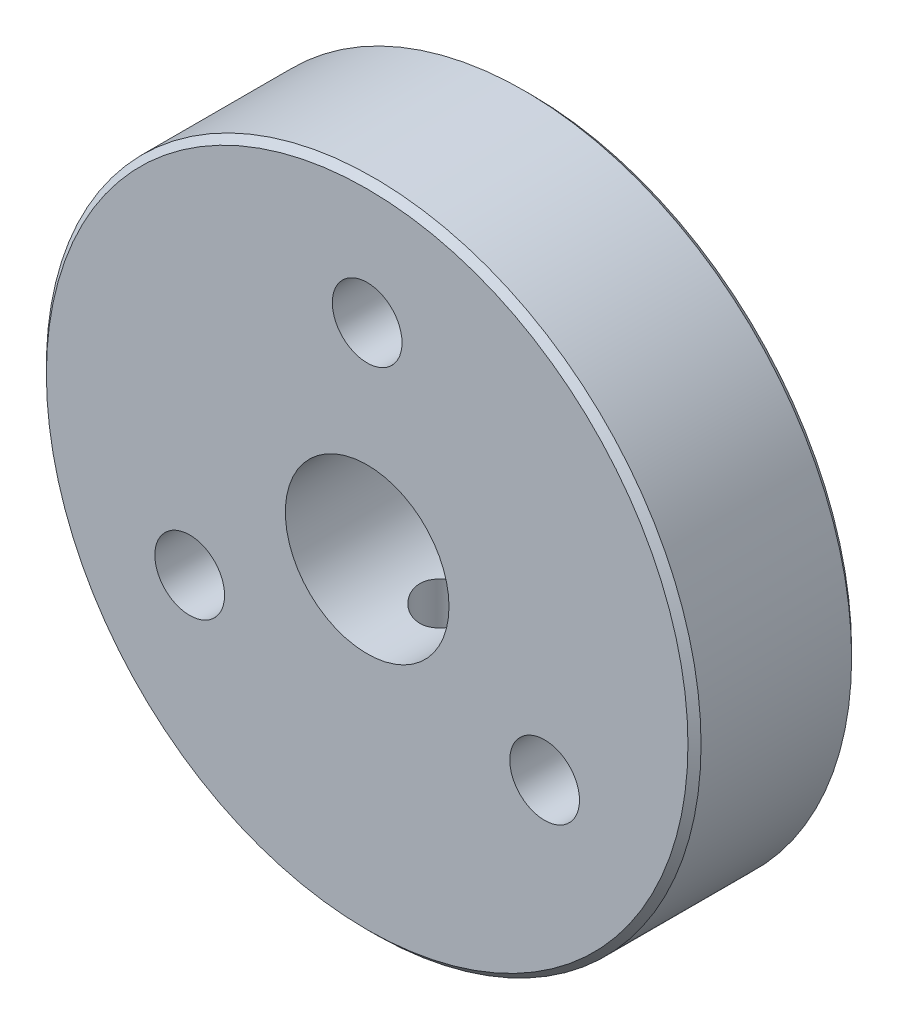
ISO-10303-21;
HEADER;
FILE_DESCRIPTION(('STEP AP214'),'2;1');
FILE_NAME('part.step','',(''),(''),'','','');
FILE_SCHEMA(('AUTOMOTIVE_DESIGN { 1 0 10303 214 1 1 1 1 }'));
ENDSEC;
DATA;
#1=APPLICATION_CONTEXT('core data for automotive mechanical design processes');
#2=APPLICATION_PROTOCOL_DEFINITION('international standard','automotive_design',2000,#1);
#3=PRODUCT_CONTEXT('',#1,'mechanical');
#4=PRODUCT('Part','Part','',(#3));
#5=PRODUCT_RELATED_PRODUCT_CATEGORY('part','',(#4));
#6=PRODUCT_DEFINITION_FORMATION('','',#4);
#7=PRODUCT_DEFINITION_CONTEXT('part definition',#1,'design');
#8=PRODUCT_DEFINITION('design','',#6,#7);
#9=PRODUCT_DEFINITION_SHAPE('','',#8);
#10=(LENGTH_UNIT() NAMED_UNIT(*) SI_UNIT(.MILLI.,.METRE.));
#11=(NAMED_UNIT(*) PLANE_ANGLE_UNIT() SI_UNIT($,.RADIAN.));
#12=(NAMED_UNIT(*) SI_UNIT($,.STERADIAN.) SOLID_ANGLE_UNIT());
#13=UNCERTAINTY_MEASURE_WITH_UNIT(LENGTH_MEASURE(1.E-05),#10,'distance_accuracy_value','');
#14=(GEOMETRIC_REPRESENTATION_CONTEXT(3) GLOBAL_UNCERTAINTY_ASSIGNED_CONTEXT((#13)) GLOBAL_UNIT_ASSIGNED_CONTEXT((#10,
#11,#12)) REPRESENTATION_CONTEXT('',''));
#15=CARTESIAN_POINT('',(0.,0.,0.));
#16=DIRECTION('',(0.,0.,1.));
#17=DIRECTION('',(1.,0.,0.));
#18=AXIS2_PLACEMENT_3D('',#15,#16,#17);
#19=CARTESIAN_POINT('',(0.,0.,3.175));
#20=DIRECTION('',(0.,0.,1.));
#21=DIRECTION('',(1.,0.,0.));
#22=AXIS2_PLACEMENT_3D('',#19,#20,#21);
#23=PLANE('',#22);
#24=CARTESIAN_POINT('',(0.,7.9502,3.175));
#25=DIRECTION('',(0.,0.,1.));
#26=DIRECTION('',(1.,0.,0.));
#27=AXIS2_PLACEMENT_3D('',#24,#25,#26);
#28=CIRCLE('',#27,1.35255);
#29=CARTESIAN_POINT('',(1.35255000000003,7.9502,3.175));
#30=VERTEX_POINT('',#29);
#31=EDGE_CURVE('E131',#30,#30,#28,.T.);
#32=ORIENTED_EDGE('',*,*,#31,.F.);
#33=EDGE_LOOP('',(#32));
#34=FACE_BOUND('',#33,.T.);
#35=CARTESIAN_POINT('',(6.88507516516696,-3.97510000000015,3.175));
#36=DIRECTION('',(0.,0.,1.));
#37=DIRECTION('',(1.,0.,0.));
#38=AXIS2_PLACEMENT_3D('',#35,#36,#37);
#39=CIRCLE('',#38,1.35255);
#40=CARTESIAN_POINT('',(8.23762516516696,-3.97510000000015,3.175));
#41=VERTEX_POINT('',#40);
#42=EDGE_CURVE('E123',#41,#41,#39,.T.);
#43=ORIENTED_EDGE('',*,*,#42,.F.);
#44=EDGE_LOOP('',(#43));
#45=FACE_BOUND('',#44,.T.);
#46=CARTESIAN_POINT('',(-6.88507516516706,-3.97509999999997,3.175));
#47=DIRECTION('',(0.,0.,1.));
#48=DIRECTION('',(1.,0.,0.));
#49=AXIS2_PLACEMENT_3D('',#46,#47,#48);
#50=CIRCLE('',#49,1.35255);
#51=CARTESIAN_POINT('',(-5.53252516516706,-3.97509999999997,3.175));
#52=VERTEX_POINT('',#51);
#53=EDGE_CURVE('E115',#52,#52,#50,.T.);
#54=ORIENTED_EDGE('',*,*,#53,.F.);
#55=EDGE_LOOP('',(#54));
#56=FACE_BOUND('',#55,.T.);
#57=CARTESIAN_POINT('',(0.,0.,3.175));
#58=DIRECTION('',(0.,0.,1.));
#59=DIRECTION('',(1.,0.,0.));
#60=AXIS2_PLACEMENT_3D('',#57,#58,#59);
#61=CIRCLE('',#60,12.446);
#62=CARTESIAN_POINT('',(12.446,0.,3.175));
#63=VERTEX_POINT('',#62);
#64=EDGE_CURVE('E80',#63,#63,#61,.T.);
#65=ORIENTED_EDGE('',*,*,#64,.T.);
#66=EDGE_LOOP('',(#65));
#67=FACE_BOUND('',#66,.T.);
#68=CARTESIAN_POINT('',(0.,0.,3.175));
#69=DIRECTION('',(0.,0.,1.));
#70=DIRECTION('',(1.,0.,0.));
#71=AXIS2_PLACEMENT_3D('',#68,#69,#70);
#72=CIRCLE('',#71,3.175);
#73=CARTESIAN_POINT('',(3.175,0.,3.175));
#74=VERTEX_POINT('',#73);
#75=EDGE_CURVE('E103',#74,#74,#72,.T.);
#76=ORIENTED_EDGE('',*,*,#75,.F.);
#77=EDGE_LOOP('',(#76));
#78=FACE_BOUND('',#77,.T.);
#79=ADVANCED_FACE('F66',(#34,#45,#56,#67,#78),#23,.T.);
#80=CARTESIAN_POINT('',(0.,0.,-3.175));
#81=DIRECTION('',(0.,0.,1.));
#82=DIRECTION('',(1.,0.,0.));
#83=AXIS2_PLACEMENT_3D('',#80,#81,#82);
#84=PLANE('',#83);
#85=CARTESIAN_POINT('',(0.,7.9502,-3.175));
#86=DIRECTION('',(0.,0.,1.));
#87=DIRECTION('',(1.,0.,0.));
#88=AXIS2_PLACEMENT_3D('',#85,#86,#87);
#89=CIRCLE('',#88,1.35255);
#90=CARTESIAN_POINT('',(1.35255000000003,7.9502,-3.175));
#91=VERTEX_POINT('',#90);
#92=EDGE_CURVE('E127',#91,#91,#89,.T.);
#93=ORIENTED_EDGE('',*,*,#92,.T.);
#94=EDGE_LOOP('',(#93));
#95=FACE_BOUND('',#94,.T.);
#96=CARTESIAN_POINT('',(6.88507516516696,-3.97510000000015,-3.175));
#97=DIRECTION('',(0.,0.,1.));
#98=DIRECTION('',(1.,0.,0.));
#99=AXIS2_PLACEMENT_3D('',#96,#97,#98);
#100=CIRCLE('',#99,1.35255);
#101=CARTESIAN_POINT('',(8.23762516516696,-3.97510000000015,-3.175));
#102=VERTEX_POINT('',#101);
#103=EDGE_CURVE('E119',#102,#102,#100,.T.);
#104=ORIENTED_EDGE('',*,*,#103,.T.);
#105=EDGE_LOOP('',(#104));
#106=FACE_BOUND('',#105,.T.);
#107=CARTESIAN_POINT('',(-6.88507516516706,-3.97509999999997,-3.175));
#108=DIRECTION('',(0.,0.,1.));
#109=DIRECTION('',(1.,0.,0.));
#110=AXIS2_PLACEMENT_3D('',#107,#108,#109);
#111=CIRCLE('',#110,1.35255);
#112=CARTESIAN_POINT('',(-5.53252516516706,-3.97509999999997,-3.175));
#113=VERTEX_POINT('',#112);
#114=EDGE_CURVE('E108',#113,#113,#111,.T.);
#115=ORIENTED_EDGE('',*,*,#114,.T.);
#116=EDGE_LOOP('',(#115));
#117=FACE_BOUND('',#116,.T.);
#118=CARTESIAN_POINT('',(0.,0.,-3.175));
#119=DIRECTION('',(0.,0.,1.));
#120=DIRECTION('',(1.,0.,0.));
#121=AXIS2_PLACEMENT_3D('',#118,#119,#120);
#122=CIRCLE('',#121,12.446);
#123=CARTESIAN_POINT('',(12.446,0.,-3.175));
#124=VERTEX_POINT('',#123);
#125=EDGE_CURVE('E86',#124,#124,#122,.F.);
#126=ORIENTED_EDGE('',*,*,#125,.T.);
#127=EDGE_LOOP('',(#126));
#128=FACE_BOUND('',#127,.T.);
#129=CARTESIAN_POINT('',(0.,0.,-3.175));
#130=DIRECTION('',(0.,0.,1.));
#131=DIRECTION('',(1.,0.,0.));
#132=AXIS2_PLACEMENT_3D('',#129,#130,#131);
#133=CIRCLE('',#132,3.175);
#134=CARTESIAN_POINT('',(3.175,0.,-3.175));
#135=VERTEX_POINT('',#134);
#136=EDGE_CURVE('E104',#135,#135,#133,.T.);
#137=ORIENTED_EDGE('',*,*,#136,.T.);
#138=EDGE_LOOP('',(#137));
#139=FACE_BOUND('',#138,.T.);
#140=ADVANCED_FACE('F165',(#95,#106,#117,#128,#139),#84,.F.);
#141=CARTESIAN_POINT('',(0.,0.,3.175));
#142=DIRECTION('',(0.,0.,-1.));
#143=DIRECTION('',(-1.,0.,0.));
#144=AXIS2_PLACEMENT_3D('',#141,#142,#143);
#145=CYLINDRICAL_SURFACE('',#144,12.7);
#146=CARTESIAN_POINT('',(-1.01856599499896,-12.6590885794555,-1.01455469719306));
#147=CARTESIAN_POINT('',(-1.06777935996552,-12.6551289481404,-0.9602667270985));
#148=CARTESIAN_POINT('',(-1.11288456501695,-12.651211115827,-0.902219990724273));
#149=CARTESIAN_POINT('',(-1.19403357340193,-12.6438107010971,-0.780033012646186));
#150=CARTESIAN_POINT('',(-1.23006837411032,-12.6403285528189,-0.715886803345802));
#151=CARTESIAN_POINT('',(-1.29651083842735,-12.6336979635186,-0.57424882101493));
#152=CARTESIAN_POINT('',(-1.32555920488906,-12.6306533053362,-0.496110456718519));
#153=CARTESIAN_POINT('',(-1.37057776919976,-12.6258477472939,-0.336115955753952));
#154=CARTESIAN_POINT('',(-1.3865448955865,-12.6240871489408,-0.254258950711837));
#155=CARTESIAN_POINT('',(-1.40532031918826,-12.6220113395381,-0.0867678463022914));
#156=CARTESIAN_POINT('',(-1.40775905049329,-12.6217367271964,-0.00109156300284166));
#157=CARTESIAN_POINT('',(-1.39842856543426,-12.6227737863963,0.169476775339011));
#158=CARTESIAN_POINT('',(-1.3866585193942,-12.6240855505692,0.254368784294553));
#159=CARTESIAN_POINT('',(-1.34901934120854,-12.6281631934404,0.421631019079898));
#160=CARTESIAN_POINT('',(-1.32304187235654,-12.6309402396324,0.503976664085946));
#161=CARTESIAN_POINT('',(-1.25749687040558,-12.6376335191431,0.663032295279327));
#162=CARTESIAN_POINT('',(-1.21792937904054,-12.6415497489635,0.739742298772402));
#163=CARTESIAN_POINT('',(-1.1267581566759,-12.6499990559549,0.88415968335355));
#164=CARTESIAN_POINT('',(-1.07532475103146,-12.6545230574904,0.951974949778696));
#165=CARTESIAN_POINT('',(-0.961400783980244,-12.6636867746431,1.07758271499526));
#166=CARTESIAN_POINT('',(-0.898912341269262,-12.6683264679419,1.13537713008602));
#167=CARTESIAN_POINT('',(-0.767006606972737,-12.6769831684423,1.23698526581895));
#168=CARTESIAN_POINT('',(-0.697922745648417,-12.681016654809,1.28122996568699));
#169=CARTESIAN_POINT('',(-0.552982890773223,-12.6881621868982,1.35682679815604));
#170=CARTESIAN_POINT('',(-0.477129191132589,-12.6912745432077,1.38818327780107));
#171=CARTESIAN_POINT('',(-0.32478372848182,-12.6960638396279,1.43555286393101));
#172=CARTESIAN_POINT('',(-0.248502877593077,-12.6978032940712,1.45223872832953));
#173=CARTESIAN_POINT('',(-0.0941899566152355,-12.6998848216853,1.47214085010944));
#174=CARTESIAN_POINT('',(-0.0161583044664618,-12.7002272248569,1.47536028843215));
#175=CARTESIAN_POINT('',(0.136652858436766,-12.6994870933027,1.46832741707033));
#176=CARTESIAN_POINT('',(0.211453702272819,-12.6984519399579,1.45852308369543));
#177=CARTESIAN_POINT('',(0.358341870872775,-12.6951561732157,1.42659289105142));
#178=CARTESIAN_POINT('',(0.430429235475015,-12.6928955778173,1.40446721275529));
#179=CARTESIAN_POINT('',(0.570187088972885,-12.6873874598792,1.34859162903364));
#180=CARTESIAN_POINT('',(0.637841262835307,-12.684136516135,1.31480137301867));
#181=CARTESIAN_POINT('',(0.766764961308602,-12.6769967660973,1.23674713548987));
#182=CARTESIAN_POINT('',(0.82803351837979,-12.6731078633702,1.19248157008545));
#183=CARTESIAN_POINT('',(0.944880939297458,-12.6649421632559,1.09304114172753));
#184=CARTESIAN_POINT('',(1.00016981793522,-12.6606563817003,1.03752654405262));
#185=CARTESIAN_POINT('',(1.10114484432322,-12.6522746357751,0.918352947369969));
#186=CARTESIAN_POINT('',(1.14682889220139,-12.648178713066,0.854692172274255));
#187=CARTESIAN_POINT('',(1.22955117035318,-12.6404120349761,0.717817186822992));
#188=CARTESIAN_POINT('',(1.26608215021364,-12.6367703091586,0.644294596924393));
#189=CARTESIAN_POINT('',(1.32680592005392,-12.6305392322281,0.492278273812366));
#190=CARTESIAN_POINT('',(1.35099641179657,-12.6279500771593,0.413783617681345));
#191=CARTESIAN_POINT('',(1.38716913168147,-12.6240290574787,0.251081374436562));
#192=CARTESIAN_POINT('',(1.39869060477786,-12.6227447663364,0.166769936497564));
#193=CARTESIAN_POINT('',(1.4077254209835,-12.6217403560962,-0.00261298018836294));
#194=CARTESIAN_POINT('',(1.40523720852784,-12.6220204106955,-0.0876845422885616));
#195=CARTESIAN_POINT('',(1.38616427795824,-12.6241293503412,-0.257475802201915));
#196=CARTESIAN_POINT('',(1.36937490554097,-12.6259807200312,-0.342172355019299));
#197=CARTESIAN_POINT('',(1.32179639132477,-12.631049926044,-0.507504436863517));
#198=CARTESIAN_POINT('',(1.29100687275052,-12.6342677991422,-0.588139856531279));
#199=CARTESIAN_POINT('',(1.21636932432176,-12.641670655105,-0.742446131312238));
#200=CARTESIAN_POINT('',(1.17260623426251,-12.6458493088541,-0.816158302750123));
#201=CARTESIAN_POINT('',(1.07298510911216,-12.6546905969574,-0.954880966479328));
#202=CARTESIAN_POINT('',(1.01712854059988,-12.6593531725905,-1.01989251235192));
#203=CARTESIAN_POINT('',(0.896536093161028,-12.668455483673,-1.13725892611313));
#204=CARTESIAN_POINT('',(0.832105153555628,-12.6728977584332,-1.18992650297639));
#205=CARTESIAN_POINT('',(0.694921562684951,-12.6811589075347,-1.28306989202841));
#206=CARTESIAN_POINT('',(0.622171498875595,-12.6849779748171,-1.32354948083279));
#207=CARTESIAN_POINT('',(0.474085698717592,-12.6913541717671,-1.3891414405637));
#208=CARTESIAN_POINT('',(0.399032778063965,-12.6939622321142,-1.41488736754523));
#209=CARTESIAN_POINT('',(0.24555252831014,-12.6978575095129,-1.45285210271825));
#210=CARTESIAN_POINT('',(0.167126284837625,-12.6991451482471,-1.46507522957532));
#211=CARTESIAN_POINT('',(0.0126513729709438,-12.700218829601,-1.4752828972933));
#212=CARTESIAN_POINT('',(-0.0633594548010816,-12.7000654537086,-1.47384186666785));
#213=CARTESIAN_POINT('',(-0.214037788189186,-12.6984197524929,-1.45814822237988));
#214=CARTESIAN_POINT('',(-0.288705207681909,-12.6969273416362,-1.44389479030261));
#215=CARTESIAN_POINT('',(-0.433884111852518,-12.6927923295812,-1.40330674867784));
#216=CARTESIAN_POINT('',(-0.504427574104128,-12.6901604630619,-1.37708477128717));
#217=CARTESIAN_POINT('',(-0.640224581249642,-12.6840345280549,-1.31352121902724));
#218=CARTESIAN_POINT('',(-0.70548127451704,-12.6805409778056,-1.27618632496805));
#219=CARTESIAN_POINT('',(-0.813319304512204,-12.674014610559,-1.202452409577));
#220=CARTESIAN_POINT('',(-0.857433192243053,-12.6710922637695,-1.16825325335951));
#221=CARTESIAN_POINT('',(-0.941344620762744,-12.6651347320017,-1.09494476980917));
#222=CARTESIAN_POINT('',(-0.981143062828058,-12.6620995707631,-1.05583647144129));
#223=CARTESIAN_POINT('',(-1.01856599499896,-12.6590885794555,-1.01455469719306));
#224=B_SPLINE_CURVE_WITH_KNOTS('',3,(#146,#147,#148,#149,#150,#151,#152,#153,#154,#155,#156,
#157,#158,#159,#160,#161,#162,#163,#164,#165,#166,#167,#168,#169,#170,#171,#172,#173,#174,#175,
#176,#177,#178,#179,#180,#181,#182,#183,#184,#185,#186,#187,#188,#189,#190,#191,#192,#193,#194,
#195,#196,#197,#198,#199,#200,#201,#202,#203,#204,#205,#206,#207,#208,#209,#210,#211,#212,#213,
#214,#215,#216,#217,#218,#219,#220,#221,#222,#223),.UNSPECIFIED.,.T.,.F.,(4,2,2,2,2,2,2,2,2,2,2,
2,2,2,2,2,2,2,2,2,2,2,2,2,2,2,2,2,2,2,2,2,2,2,2,2,2,2,4),(0.,0.219980916490328,
0.440179316710136,0.689278460018113,0.938436074809918,1.19436780396887,1.45031447816351,
1.70824061445378,1.96616595867985,2.22059701230149,2.4749793569785,2.72013710595396,
2.96521209813486,3.19835386278341,3.4314405532674,3.65671381484796,3.88198376775563,
4.10804092486646,4.33413228419696,4.56849124234626,4.80290138445377,5.04832845767661,
5.29380122146604,5.54793317280883,5.80209334223966,6.05995293592681,6.31781946960427,
6.57403366044263,6.83021679751475,7.07896081801577,7.32762768225191,7.564591796646,
7.80148021189261,8.02845571544188,8.25544571848217,8.48034228453971,8.70510392048968,
8.87241728997574,9.03969564865547),.UNSPECIFIED.);
#225=CARTESIAN_POINT('',(-1.01856599499896,-12.6590885794555,-1.01455469719306));
#226=VERTEX_POINT('',#225);
#227=EDGE_CURVE('E12',#226,#226,#224,.T.);
#228=ORIENTED_EDGE('',*,*,#227,.T.);
#229=EDGE_LOOP('',(#228));
#230=FACE_BOUND('',#229,.T.);
#231=CARTESIAN_POINT('',(0.,0.,-2.921));
#232=DIRECTION('',(0.,0.,1.));
#233=DIRECTION('',(1.,0.,0.));
#234=AXIS2_PLACEMENT_3D('',#231,#232,#233);
#235=CIRCLE('',#234,12.7);
#236=CARTESIAN_POINT('',(12.7,0.,-2.921));
#237=VERTEX_POINT('',#236);
#238=EDGE_CURVE('E93',#237,#237,#235,.T.);
#239=ORIENTED_EDGE('',*,*,#238,.T.);
#240=EDGE_LOOP('',(#239));
#241=FACE_BOUND('',#240,.T.);
#242=CARTESIAN_POINT('',(0.,0.,2.921));
#243=DIRECTION('',(0.,0.,1.));
#244=DIRECTION('',(1.,0.,0.));
#245=AXIS2_PLACEMENT_3D('',#242,#243,#244);
#246=CIRCLE('',#245,12.7);
#247=CARTESIAN_POINT('',(12.7,0.,2.921));
#248=VERTEX_POINT('',#247);
#249=EDGE_CURVE('E99',#248,#248,#246,.F.);
#250=ORIENTED_EDGE('',*,*,#249,.T.);
#251=EDGE_LOOP('',(#250));
#252=FACE_BOUND('',#251,.T.);
#253=ADVANCED_FACE('F171',(#230,#241,#252),#145,.T.);
#254=CARTESIAN_POINT('',(0.,0.,3.175));
#255=DIRECTION('',(0.,0.,-1.));
#256=DIRECTION('',(-1.,0.,0.));
#257=AXIS2_PLACEMENT_3D('',#254,#255,#256);
#258=CYLINDRICAL_SURFACE('',#257,3.175);
#259=CARTESIAN_POINT('',(0.,-3.175,-1.1303));
#260=CARTESIAN_POINT('',(-0.0614285544766779,-3.17500087649076,-1.13030122375743));
#261=CARTESIAN_POINT('',(-0.122848391480888,-3.17320130070143,-1.12527632101687));
#262=CARTESIAN_POINT('',(-0.243864611742385,-3.1662010034201,-1.10538141456425));
#263=CARTESIAN_POINT('',(-0.303461052111787,-3.16100038856924,-1.09051171954004));
#264=CARTESIAN_POINT('',(-0.419068309151047,-3.14775949893737,-1.05151155002785));
#265=CARTESIAN_POINT('',(-0.475085403185977,-3.13972436624609,-1.02739783825833));
#266=CARTESIAN_POINT('',(-0.582278041616506,-3.12162393487057,-0.970674959877598));
#267=CARTESIAN_POINT('',(-0.633452431498653,-3.11155815385673,-0.938063774366824));
#268=CARTESIAN_POINT('',(-0.731495005230031,-3.09000790855595,-0.863944920073516));
#269=CARTESIAN_POINT('',(-0.778149616243898,-3.07848610582585,-0.822165683101444));
#270=CARTESIAN_POINT('',(-0.863958107942659,-3.055516031792,-0.731473458691628));
#271=CARTESIAN_POINT('',(-0.903110009958691,-3.04406778065305,-0.682558595368709));
#272=CARTESIAN_POINT('',(-0.974093633832357,-3.02211785986225,-0.576974309823008));
#273=CARTESIAN_POINT('',(-1.00563502809097,-3.01166094904186,-0.520099481666731));
#274=CARTESIAN_POINT('',(-1.0586113470591,-2.99345244738711,-0.401420602400137));
#275=CARTESIAN_POINT('',(-1.08004985661479,-2.98569989720789,-0.339618308836504));
#276=CARTESIAN_POINT('',(-1.11138819305283,-2.9741742173714,-0.215285055150901));
#277=CARTESIAN_POINT('',(-1.12169236541681,-2.97026214805178,-0.152869300216101));
#278=CARTESIAN_POINT('',(-1.13173392893205,-2.96645158379256,-0.0270815214047249));
#279=CARTESIAN_POINT('',(-1.13147514856467,-2.96655163468287,0.0362901476816091));
#280=CARTESIAN_POINT('',(-1.12070953557278,-2.97063328242024,0.158613366101805));
#281=CARTESIAN_POINT('',(-1.11074743190181,-2.9744085523292,0.21762097911382));
#282=CARTESIAN_POINT('',(-1.08175290027524,-2.98507483987672,0.333064642409357));
#283=CARTESIAN_POINT('',(-1.06271924100948,-2.99196628047622,0.389500342459561));
#284=CARTESIAN_POINT('',(-1.01579639288465,-3.00822311818093,0.499367623295951));
#285=CARTESIAN_POINT('',(-0.987756625641375,-3.01763009039321,0.552728473537324));
#286=CARTESIAN_POINT('',(-0.923722187948486,-3.03784253722576,0.654152260726013));
#287=CARTESIAN_POINT('',(-0.887724971743381,-3.04864845893998,0.702213494822719));
#288=CARTESIAN_POINT('',(-0.806247147627666,-3.0712342285018,0.794711224911271));
#289=CARTESIAN_POINT('',(-0.760326653485441,-3.08303358094073,0.83875635543315));
#290=CARTESIAN_POINT('',(-0.661610098844968,-3.10571393948941,0.918630406902953));
#291=CARTESIAN_POINT('',(-0.60881318146775,-3.11659483086972,0.954458302353039));
#292=CARTESIAN_POINT('',(-0.496923650490421,-3.13639217173446,1.01725643876643));
#293=CARTESIAN_POINT('',(-0.437759573781158,-3.14528190725224,1.04410836273789));
#294=CARTESIAN_POINT('',(-0.315359989841962,-3.15989936928577,1.08735200192041));
#295=CARTESIAN_POINT('',(-0.252126116160289,-3.16562835574328,1.10374788553834));
#296=CARTESIAN_POINT('',(-0.126684885961715,-3.17306329879329,1.12488948929031));
#297=CARTESIAN_POINT('',(-0.0645771816882164,-3.17495136824996,1.1301630443381));
#298=CARTESIAN_POINT('',(0.0596565359676967,-3.17504672531149,1.13043160042333));
#299=CARTESIAN_POINT('',(0.121782543364873,-3.1732547352019,1.12542861843736));
#300=CARTESIAN_POINT('',(0.242087689559501,-3.16631168752833,1.10569555255757));
#301=CARTESIAN_POINT('',(0.30032923111041,-3.16127656517542,1.09130097687732));
#302=CARTESIAN_POINT('',(0.413538192846499,-3.14846933320479,1.05362458392996));
#303=CARTESIAN_POINT('',(0.468505187040127,-3.14069686838655,1.03034161326217));
#304=CARTESIAN_POINT('',(0.575332725471091,-3.12292068057346,0.974831097632251));
#305=CARTESIAN_POINT('',(0.627062417893483,-3.11286035066926,0.942370399820989));
#306=CARTESIAN_POINT('',(0.724505279210261,-3.09163517782237,0.86969392625776));
#307=CARTESIAN_POINT('',(0.770216385550682,-3.08046995852104,0.829475503532218));
#308=CARTESIAN_POINT('',(0.856811848575499,-3.05754963314883,0.739951586358952));
#309=CARTESIAN_POINT('',(0.89732026123192,-3.0457941243994,0.690281624884846));
#310=CARTESIAN_POINT('',(0.969488296473175,-3.02359841598846,0.584605887343713));
#311=CARTESIAN_POINT('',(1.00114750732455,-3.01315827754058,0.528599816642027));
#312=CARTESIAN_POINT('',(1.0546547707943,-2.99485112677041,0.411607263091931));
#313=CARTESIAN_POINT('',(1.07649405053024,-2.98698641696941,0.350616384187454));
#314=CARTESIAN_POINT('',(1.1094694490286,-2.97489781303426,0.225470366059666));
#315=CARTESIAN_POINT('',(1.1206113170349,-2.97067196334806,0.161316946034553));
#316=CARTESIAN_POINT('',(1.13139068963521,-2.96658222044346,0.0356943439521811));
#317=CARTESIAN_POINT('',(1.13166111008653,-2.96647835747859,-0.0257132404761808));
#318=CARTESIAN_POINT('',(1.12228164306422,-2.97003931415378,-0.147648882354413));
#319=CARTESIAN_POINT('',(1.11263251765991,-2.97370384428697,-0.208177007006533));
#320=CARTESIAN_POINT('',(1.08416089230555,-2.98419839475885,-0.325127051192539));
#321=CARTESIAN_POINT('',(1.06557142470547,-2.99094779649679,-0.38161353131441));
#322=CARTESIAN_POINT('',(1.01994372799953,-3.0068123311106,-0.49070459232397));
#323=CARTESIAN_POINT('',(0.992903472899546,-3.01592803119462,-0.543308238597662));
#324=CARTESIAN_POINT('',(0.929616151238461,-3.03604854272463,-0.645909488675432));
#325=CARTESIAN_POINT('',(0.892986233526775,-3.0471235224069,-0.695657048848299));
#326=CARTESIAN_POINT('',(0.812177154252536,-3.06964995874745,-0.788502707435913));
#327=CARTESIAN_POINT('',(0.767995717285477,-3.08110152803636,-0.831598794175539));
#328=CARTESIAN_POINT('',(0.670861718733729,-3.10373428576573,-0.911963578799143));
#329=CARTESIAN_POINT('',(0.617595515492278,-3.11487776157142,-0.948865332174022));
#330=CARTESIAN_POINT('',(0.505234578584047,-3.13506244460878,-1.01316548821053));
#331=CARTESIAN_POINT('',(0.446140340356565,-3.14410383031939,-1.04056469778738));
#332=CARTESIAN_POINT('',(0.323645197027849,-3.15906443826106,-1.08493350082546));
#333=CARTESIAN_POINT('',(0.260236860921375,-3.16497811106267,-1.10188456513346));
#334=CARTESIAN_POINT('',(0.131215131612621,-3.17294468299437,-1.12456500771492));
#335=CARTESIAN_POINT('',(0.0656025945972248,-3.17499906395212,-1.13029869308885));
#336=CARTESIAN_POINT('',(0.,-3.175,-1.1303));
#337=B_SPLINE_CURVE_WITH_KNOTS('',3,(#259,#260,#261,#262,#263,#264,#265,#266,#267,#268,#269,
#270,#271,#272,#273,#274,#275,#276,#277,#278,#279,#280,#281,#282,#283,#284,#285,#286,#287,#288,
#289,#290,#291,#292,#293,#294,#295,#296,#297,#298,#299,#300,#301,#302,#303,#304,#305,#306,#307,
#308,#309,#310,#311,#312,#313,#314,#315,#316,#317,#318,#319,#320,#321,#322,#323,#324,#325,#326,
#327,#328,#329,#330,#331,#332,#333,#334,#335,#336),.UNSPECIFIED.,.T.,.F.,(4,2,2,2,2,2,2,2,2,2,2,
2,2,2,2,2,2,2,2,2,2,2,2,2,2,2,2,2,2,2,2,2,2,2,2,2,2,2,4),(0.,0.18404394145956,0.368082112412806,
0.551788122807083,0.735537819443366,0.925722644883205,1.11595755842548,1.31258758821648,
1.50914779437035,1.69830149435247,1.88738663727476,2.06643452933681,2.24550673104465,
2.42774410221586,2.61003985955346,2.80329006106037,2.99656436677723,3.19229416831945,
3.3879458913255,3.57408187032768,3.7601813198999,3.93997181359128,4.11978564569259,
4.30465683345396,4.48959121210529,4.68416822385536,4.8787542873297,5.07351384543878,
5.26816867279116,5.45147357003618,5.63476438593103,5.81351722268549,5.99231294661076,
6.179778260035,6.36730015993202,6.56359488860405,6.75987294468714,6.95649809396631,
7.15304773089828),.UNSPECIFIED.);
#338=CARTESIAN_POINT('',(0.,-3.175,-1.1303));
#339=VERTEX_POINT('',#338);
#340=EDGE_CURVE('E135',#339,#339,#337,.T.);
#341=ORIENTED_EDGE('',*,*,#340,.F.);
#342=EDGE_LOOP('',(#341));
#343=FACE_BOUND('',#342,.T.);
#344=ORIENTED_EDGE('',*,*,#75,.T.);
#345=EDGE_LOOP('',(#344));
#346=FACE_BOUND('',#345,.T.);
#347=ORIENTED_EDGE('',*,*,#136,.F.);
#348=EDGE_LOOP('',(#347));
#349=FACE_BOUND('',#348,.T.);
#350=ADVANCED_FACE('F177',(#343,#346,#349),#258,.F.);
#351=CARTESIAN_POINT('',(0.,0.,-2.921));
#352=DIRECTION('',(0.,0.,1.));
#353=DIRECTION('',(1.,0.,0.));
#354=AXIS2_PLACEMENT_3D('',#351,#352,#353);
#355=CONICAL_SURFACE('',#354,12.7,0.785398163397448);
#356=ORIENTED_EDGE('',*,*,#125,.F.);
#357=EDGE_LOOP('',(#356));
#358=FACE_BOUND('',#357,.T.);
#359=ORIENTED_EDGE('',*,*,#238,.F.);
#360=EDGE_LOOP('',(#359));
#361=FACE_BOUND('',#360,.T.);
#362=ADVANCED_FACE('F182',(#358,#361),#355,.T.);
#363=CARTESIAN_POINT('',(0.,0.,3.175));
#364=DIRECTION('',(0.,0.,-1.));
#365=DIRECTION('',(-1.,0.,0.));
#366=AXIS2_PLACEMENT_3D('',#363,#364,#365);
#367=CONICAL_SURFACE('',#366,12.446,0.785398163397442);
#368=ORIENTED_EDGE('',*,*,#249,.F.);
#369=EDGE_LOOP('',(#368));
#370=FACE_BOUND('',#369,.T.);
#371=ORIENTED_EDGE('',*,*,#64,.F.);
#372=EDGE_LOOP('',(#371));
#373=FACE_BOUND('',#372,.T.);
#374=ADVANCED_FACE('F69',(#370,#373),#367,.T.);
#375=CARTESIAN_POINT('',(-6.88507516516706,-3.97509999999997,3.175));
#376=DIRECTION('',(0.,0.,1.));
#377=DIRECTION('',(1.,0.,0.));
#378=AXIS2_PLACEMENT_3D('',#375,#376,#377);
#379=CYLINDRICAL_SURFACE('',#378,1.35255);
#380=ORIENTED_EDGE('',*,*,#114,.F.);
#381=EDGE_LOOP('',(#380));
#382=FACE_BOUND('',#381,.T.);
#383=ORIENTED_EDGE('',*,*,#53,.T.);
#384=EDGE_LOOP('',(#383));
#385=FACE_BOUND('',#384,.T.);
#386=ADVANCED_FACE('F190',(#382,#385),#379,.F.);
#387=CARTESIAN_POINT('',(6.88507516516696,-3.97510000000015,3.175));
#388=DIRECTION('',(0.,0.,1.));
#389=DIRECTION('',(1.,0.,0.));
#390=AXIS2_PLACEMENT_3D('',#387,#388,#389);
#391=CYLINDRICAL_SURFACE('',#390,1.35255);
#392=ORIENTED_EDGE('',*,*,#103,.F.);
#393=EDGE_LOOP('',(#392));
#394=FACE_BOUND('',#393,.T.);
#395=ORIENTED_EDGE('',*,*,#42,.T.);
#396=EDGE_LOOP('',(#395));
#397=FACE_BOUND('',#396,.T.);
#398=ADVANCED_FACE('F160',(#394,#397),#391,.F.);
#399=CARTESIAN_POINT('',(0.,7.9502,3.175));
#400=DIRECTION('',(0.,0.,1.));
#401=DIRECTION('',(1.,0.,0.));
#402=AXIS2_PLACEMENT_3D('',#399,#400,#401);
#403=CYLINDRICAL_SURFACE('',#402,1.35255);
#404=ORIENTED_EDGE('',*,*,#92,.F.);
#405=EDGE_LOOP('',(#404));
#406=FACE_BOUND('',#405,.T.);
#407=ORIENTED_EDGE('',*,*,#31,.T.);
#408=EDGE_LOOP('',(#407));
#409=FACE_BOUND('',#408,.T.);
#410=ADVANCED_FACE('F154',(#406,#409),#403,.F.);
#411=CARTESIAN_POINT('',(0.,-12.7,0.));
#412=DIRECTION('',(0.,-1.,0.));
#413=DIRECTION('',(0.,0.,-1.));
#414=AXIS2_PLACEMENT_3D('',#411,#412,#413);
#415=CONICAL_SURFACE('',#414,1.4732,0.715584993317677);
#416=CARTESIAN_POINT('',(0.,-12.3055386731639,0.));
#417=DIRECTION('',(0.,-1.,0.));
#418=DIRECTION('',(0.,0.,-1.));
#419=AXIS2_PLACEMENT_3D('',#416,#417,#418);
#420=CIRCLE('',#419,1.1303);
#421=CARTESIAN_POINT('',(0.,-12.3055386731639,-1.1303));
#422=VERTEX_POINT('',#421);
#423=EDGE_CURVE('E144',#422,#422,#420,.T.);
#424=ORIENTED_EDGE('',*,*,#423,.F.);
#425=EDGE_LOOP('',(#424));
#426=FACE_BOUND('',#425,.T.);
#427=ORIENTED_EDGE('',*,*,#227,.F.);
#428=EDGE_LOOP('',(#427));
#429=FACE_BOUND('',#428,.T.);
#430=ADVANCED_FACE('F150',(#426,#429),#415,.F.);
#431=CARTESIAN_POINT('',(0.,-12.7,0.));
#432=DIRECTION('',(0.,-1.,0.));
#433=DIRECTION('',(0.,0.,-1.));
#434=AXIS2_PLACEMENT_3D('',#431,#432,#433);
#435=CYLINDRICAL_SURFACE('',#434,1.1303);
#436=ORIENTED_EDGE('',*,*,#423,.T.);
#437=EDGE_LOOP('',(#436));
#438=FACE_BOUND('',#437,.T.);
#439=ORIENTED_EDGE('',*,*,#340,.T.);
#440=EDGE_LOOP('',(#439));
#441=FACE_BOUND('',#440,.T.);
#442=ADVANCED_FACE('F147',(#438,#441),#435,.F.);
#443=CLOSED_SHELL('',(#79,#140,#253,#350,#362,#374,#386,#398,#410,#430,#442));
#444=MANIFOLD_SOLID_BREP('B2',#443);
#445=ADVANCED_BREP_SHAPE_REPRESENTATION('',(#18,#444),#14);
#446=SHAPE_DEFINITION_REPRESENTATION(#9,#445);
ENDSEC;
END-ISO-10303-21;
